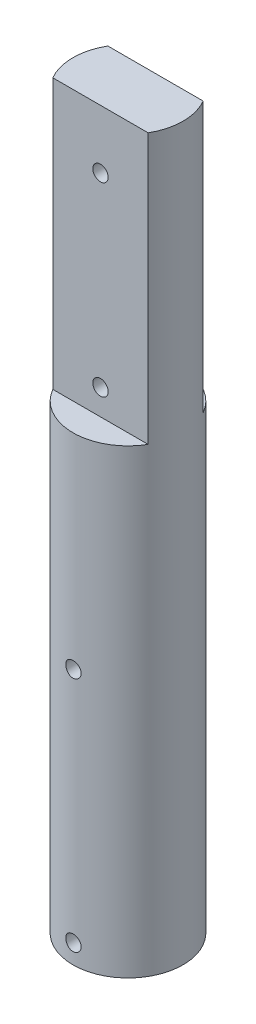
ISO-10303-21;
HEADER;
FILE_DESCRIPTION(('STEP AP214'),'2;1');
FILE_NAME('part.step','',(''),(''),'','','');
FILE_SCHEMA(('AUTOMOTIVE_DESIGN { 1 0 10303 214 1 1 1 1 }'));
ENDSEC;
DATA;
#1=APPLICATION_CONTEXT('core data for automotive mechanical design processes');
#2=APPLICATION_PROTOCOL_DEFINITION('international standard','automotive_design',2000,#1);
#3=PRODUCT_CONTEXT('',#1,'mechanical');
#4=PRODUCT('Part','Part','',(#3));
#5=PRODUCT_RELATED_PRODUCT_CATEGORY('part','',(#4));
#6=PRODUCT_DEFINITION_FORMATION('','',#4);
#7=PRODUCT_DEFINITION_CONTEXT('part definition',#1,'design');
#8=PRODUCT_DEFINITION('design','',#6,#7);
#9=PRODUCT_DEFINITION_SHAPE('','',#8);
#10=(LENGTH_UNIT() NAMED_UNIT(*) SI_UNIT(.MILLI.,.METRE.));
#11=(NAMED_UNIT(*) PLANE_ANGLE_UNIT() SI_UNIT($,.RADIAN.));
#12=(NAMED_UNIT(*) SI_UNIT($,.STERADIAN.) SOLID_ANGLE_UNIT());
#13=UNCERTAINTY_MEASURE_WITH_UNIT(LENGTH_MEASURE(1.E-05),#10,'distance_accuracy_value','');
#14=(GEOMETRIC_REPRESENTATION_CONTEXT(3) GLOBAL_UNCERTAINTY_ASSIGNED_CONTEXT((#13)) GLOBAL_UNIT_ASSIGNED_CONTEXT((#10,
#11,#12)) REPRESENTATION_CONTEXT('',''));
#15=CARTESIAN_POINT('',(0.,0.,0.));
#16=DIRECTION('',(0.,0.,1.));
#17=DIRECTION('',(1.,0.,0.));
#18=AXIS2_PLACEMENT_3D('',#15,#16,#17);
#19=CARTESIAN_POINT('',(0.,57.08,0.));
#20=DIRECTION('',(0.,-1.,0.));
#21=DIRECTION('',(0.,0.,-1.));
#22=AXIS2_PLACEMENT_3D('',#19,#20,#21);
#23=CYLINDRICAL_SURFACE('',#22,4.3);
#24=CARTESIAN_POINT('',(0.,20.6,-4.3));
#25=CARTESIAN_POINT('',(-0.0335275708954897,20.5999985978478,-4.29999948998828));
#26=CARTESIAN_POINT('',(-0.0670752568055947,20.5971802725972,-4.29960374919141));
#27=CARTESIAN_POINT('',(-0.133234765094414,20.5859832404072,-4.29806313788312));
#28=CARTESIAN_POINT('',(-0.165845612787704,20.5775989466993,-4.29691751470318));
#29=CARTESIAN_POINT('',(-0.229164259589988,20.5555238188583,-4.29400602126612));
#30=CARTESIAN_POINT('',(-0.259873409722147,20.5418368032867,-4.29224059742145));
#31=CARTESIAN_POINT('',(-0.318553827917283,20.5095536716102,-4.2882851399914));
#32=CARTESIAN_POINT('',(-0.346525514468045,20.4909583074777,-4.28609517146105));
#33=CARTESIAN_POINT('',(-0.399132362654931,20.4492514408053,-4.28151793661773));
#34=CARTESIAN_POINT('',(-0.423746219246013,20.4261131850964,-4.27912955238765));
#35=CARTESIAN_POINT('',(-0.468755033022216,20.3760348777371,-4.27443353651476));
#36=CARTESIAN_POINT('',(-0.489149760154739,20.349094618913,-4.27212590928101));
#37=CARTESIAN_POINT('',(-0.52522281386283,20.2920358674213,-4.26784178957295));
#38=CARTESIAN_POINT('',(-0.540880803565907,20.2619043998434,-4.26586674063646));
#39=CARTESIAN_POINT('',(-0.566905987390072,20.1994072364682,-4.26248646659039));
#40=CARTESIAN_POINT('',(-0.577273430901676,20.1670416460666,-4.26108121462185));
#41=CARTESIAN_POINT('',(-0.592357659935901,20.1012178549024,-4.25901051645618));
#42=CARTESIAN_POINT('',(-0.597110717131838,20.067768118182,-4.2583403234546));
#43=CARTESIAN_POINT('',(-0.600943561766012,20.000539603382,-4.25780117064252));
#44=CARTESIAN_POINT('',(-0.600023631787931,19.9667608417756,-4.25793217092285));
#45=CARTESIAN_POINT('',(-0.592566315008618,19.9000878341174,-4.25897626031051));
#46=CARTESIAN_POINT('',(-0.586069129458509,19.8671889913896,-4.25988375226073));
#47=CARTESIAN_POINT('',(-0.567704572579319,19.802953093001,-4.26236983738622));
#48=CARTESIAN_POINT('',(-0.555837068176971,19.7716160760626,-4.26394844719133));
#49=CARTESIAN_POINT('',(-0.527026323626942,19.7112699248211,-4.26760515516274));
#50=CARTESIAN_POINT('',(-0.510065861498754,19.6822691193085,-4.2696849432885));
#51=CARTESIAN_POINT('',(-0.471562935270107,19.6275099701351,-4.27410841247884));
#52=CARTESIAN_POINT('',(-0.450020210459266,19.6017518110992,-4.27645210855503));
#53=CARTESIAN_POINT('',(-0.402742670041643,19.5539759864553,-4.28116411843535));
#54=CARTESIAN_POINT('',(-0.376973251465276,19.5319925521903,-4.28353247001617));
#55=CARTESIAN_POINT('',(-0.322092287159642,19.4926575758627,-4.28800807840038));
#56=CARTESIAN_POINT('',(-0.292980730134554,19.4753060494557,-4.29011533432126));
#57=CARTESIAN_POINT('',(-0.232213629625436,19.44572644193,-4.29383310935159));
#58=CARTESIAN_POINT('',(-0.200556892049325,19.4335007825673,-4.29544339356825));
#59=CARTESIAN_POINT('',(-0.135612264376522,19.4145485681921,-4.29798376319159));
#60=CARTESIAN_POINT('',(-0.102324469702197,19.4078216918883,-4.2989138883393));
#61=CARTESIAN_POINT('',(-0.035358322451922,19.4001030056331,-4.29998392063015));
#62=CARTESIAN_POINT('',(-0.00168549874618523,19.3990640935691,-4.30013031761203));
#63=CARTESIAN_POINT('',(0.0653538297456085,19.4026261202611,-4.2996340014627));
#64=CARTESIAN_POINT('',(0.0987203426804372,19.4072269085437,-4.29899130938524));
#65=CARTESIAN_POINT('',(0.164058846929471,19.4218985824152,-4.29699305017726));
#66=CARTESIAN_POINT('',(0.196036041292868,19.4319467349736,-4.2956404464044));
#67=CARTESIAN_POINT('',(0.257851715539667,19.4572040834507,-4.29237363745077));
#68=CARTESIAN_POINT('',(0.287690106871596,19.4724134929082,-4.29045940903412));
#69=CARTESIAN_POINT('',(0.344589725167919,19.5076736387418,-4.28626620512982));
#70=CARTESIAN_POINT('',(0.371632107232839,19.527754514199,-4.28398498995698));
#71=CARTESIAN_POINT('',(0.421979686070998,19.5721453127426,-4.27931929765121));
#72=CARTESIAN_POINT('',(0.445284696155329,19.5964554469622,-4.27693481536744));
#73=CARTESIAN_POINT('',(0.487665504950375,19.6488234267959,-4.27231099718785));
#74=CARTESIAN_POINT('',(0.50670988071658,19.6769068202911,-4.27007282070155));
#75=CARTESIAN_POINT('',(0.539810994020148,19.7359015084937,-4.26601492837375));
#76=CARTESIAN_POINT('',(0.55386785157185,19.7668127351325,-4.26419520246346));
#77=CARTESIAN_POINT('',(0.576545242128529,19.8304885568759,-4.26118843893877));
#78=CARTESIAN_POINT('',(0.585182829287749,19.8632469806403,-4.25999941837257));
#79=CARTESIAN_POINT('',(0.596831068495093,19.9297671612301,-4.25838324196421));
#80=CARTESIAN_POINT('',(0.599842052660964,19.9635288587164,-4.25795604115468));
#81=CARTESIAN_POINT('',(0.600144507298717,20.0307842941412,-4.25791339524925));
#82=CARTESIAN_POINT('',(0.597485363562369,20.0642778161177,-4.25829094094571));
#83=CARTESIAN_POINT('',(0.58662832621675,20.1303365967041,-4.25980008766519));
#84=CARTESIAN_POINT('',(0.578430436973299,20.1629018560456,-4.26093168809384));
#85=CARTESIAN_POINT('',(0.556745207820723,20.2261691602408,-4.26381911509842));
#86=CARTESIAN_POINT('',(0.54326085208305,20.2568722450073,-4.26557458944993));
#87=CARTESIAN_POINT('',(0.5113903264641,20.3155881392943,-4.26951245715507));
#88=CARTESIAN_POINT('',(0.493004036126811,20.3436008826815,-4.27169486099936));
#89=CARTESIAN_POINT('',(0.451670399710898,20.3963925549525,-4.27626338760595));
#90=CARTESIAN_POINT('',(0.428686359899417,20.4211426233099,-4.27865105496591));
#91=CARTESIAN_POINT('',(0.378886995784174,20.4664525970426,-4.28334785151524));
#92=CARTESIAN_POINT('',(0.352070777188078,20.4870115216311,-4.28565696221616));
#93=CARTESIAN_POINT('',(0.295220169181282,20.5234410796524,-4.28994881478982));
#94=CARTESIAN_POINT('',(0.26517113814944,20.5392890451705,-4.29192995897052));
#95=CARTESIAN_POINT('',(0.202825627356861,20.5656901543197,-4.29532682280706));
#96=CARTESIAN_POINT('',(0.170531567358776,20.5762489010869,-4.29674314048629));
#97=CARTESIAN_POINT('',(0.11506875787627,20.5893179403315,-4.29851944143484));
#98=CARTESIAN_POINT('',(0.0922458092193598,20.5933177536102,-4.29907186458088));
#99=CARTESIAN_POINT('',(0.0462851008623457,20.5986592541178,-4.29981231808903));
#100=CARTESIAN_POINT('',(0.0231473443262198,20.6000009680421,-4.30000035211072));
#101=CARTESIAN_POINT('',(0.,20.6,-4.3));
#102=B_SPLINE_CURVE_WITH_KNOTS('',3,(#24,#25,#26,#27,#28,#29,#30,#31,#32,#33,#34,#35,#36,#37,
#38,#39,#40,#41,#42,#43,#44,#45,#46,#47,#48,#49,#50,#51,#52,#53,#54,#55,#56,#57,#58,#59,#60,#61,
#62,#63,#64,#65,#66,#67,#68,#69,#70,#71,#72,#73,#74,#75,#76,#77,#78,#79,#80,#81,#82,#83,#84,#85,
#86,#87,#88,#89,#90,#91,#92,#93,#94,#95,#96,#97,#98,#99,#100,#101),.UNSPECIFIED.,.T.,.F.,(4,2,2,
2,2,2,2,2,2,2,2,2,2,2,2,2,2,2,2,2,2,2,2,2,2,2,2,2,2,2,2,2,2,2,2,2,2,2,4),(0.,0.100498144631237,
0.201097315798383,0.30162417839486,0.402135648934119,0.50325781806992,0.604385499548968,
0.705941397439209,0.807492507654049,0.908383896114991,1.00927025899966,1.1094354742126,
1.20960317159514,1.31011347802753,1.41062950458006,1.51201376490475,1.61339836789992,
1.71483081701727,1.81625733906144,1.91684266169334,2.01742530065855,2.11759138192519,
2.21776160791049,2.31856812897261,2.41937968394664,2.52091187963721,2.6224416319992,
2.72365025159284,2.82485289702399,2.92517768800756,3.02550239991196,3.12577056060965,
3.22604118543984,3.32714649764197,3.42827544282475,3.5298833975973,3.63138348510181,
3.700767829357,3.7701514767789),.UNSPECIFIED.);
#103=CARTESIAN_POINT('',(0.,20.6,-4.3));
#104=VERTEX_POINT('',#103);
#105=EDGE_CURVE('E11',#104,#104,#102,.T.);
#106=ORIENTED_EDGE('',*,*,#105,.T.);
#107=EDGE_LOOP('',(#106));
#108=FACE_BOUND('',#107,.T.);
#109=CARTESIAN_POINT('',(0.600000000000002,20.,4.25793377120875));
#110=CARTESIAN_POINT('',(0.599998596295426,19.9664742202909,4.25793430012104));
#111=CARTESIAN_POINT('',(0.597180562007332,19.9329283205578,4.25833401086069));
#112=CARTESIAN_POINT('',(0.585984790455614,19.8667725228749,4.25988879424771));
#113=CARTESIAN_POINT('',(0.577601460026842,19.8341636010267,4.26104462678624));
#114=CARTESIAN_POINT('',(0.555529149502573,19.7708490284595,4.26397824842413));
#115=CARTESIAN_POINT('',(0.541844033576982,19.7401420104136,4.26575558445328));
#116=CARTESIAN_POINT('',(0.509565376901618,19.6814651719407,4.26973141114822));
#117=CARTESIAN_POINT('',(0.490972583540944,19.6534949356181,4.27192983767227));
#118=CARTESIAN_POINT('',(0.449268326315554,19.6008864798205,4.27651721618567));
#119=CARTESIAN_POINT('',(0.426129533826407,19.5762700176842,4.27890726597518));
#120=CARTESIAN_POINT('',(0.376049054908142,19.531256166575,4.28359876394619));
#121=CARTESIAN_POINT('',(0.349107168457574,19.5108589996526,4.28590020745939));
#122=CARTESIAN_POINT('',(0.292046961153537,19.4747833707848,4.29016657082425));
#123=CARTESIAN_POINT('',(0.261915945421763,19.4591248041596,4.29213005727407));
#124=CARTESIAN_POINT('',(0.19941976311111,19.4330984294994,4.29548715382562));
#125=CARTESIAN_POINT('',(0.167054699129085,19.4227303786848,4.29688079007695));
#126=CARTESIAN_POINT('',(0.101232641053802,19.4076449158011,4.29893342127308));
#127=CARTESIAN_POINT('',(0.0677841244297413,19.4028911670605,4.29959713842488));
#128=CARTESIAN_POINT('',(0.000558007541838529,19.3990565164659,4.30013130804566));
#129=CARTESIAN_POINT('',(-0.0332195766999144,19.3999753397828,4.3000017989455));
#130=CARTESIAN_POINT('',(-0.0998974001463253,19.4074308803803,4.29896790198468));
#131=CARTESIAN_POINT('',(-0.132802105181252,19.4139285113459,4.2980689054519));
#132=CARTESIAN_POINT('',(-0.197049497264932,19.4322959817346,4.2956030641155));
#133=CARTESIAN_POINT('',(-0.228392148593683,19.444165943946,4.29403620404744));
#134=CARTESIAN_POINT('',(-0.288745223083572,19.4729818263627,4.29040139870199));
#135=CARTESIAN_POINT('',(-0.317747590654341,19.4899444032253,4.28833181344418));
#136=CARTESIAN_POINT('',(-0.372508971958373,19.5284518693034,4.28392260871992));
#137=CARTESIAN_POINT('',(-0.398267800480895,19.5499970200019,4.28158297384784));
#138=CARTESIAN_POINT('',(-0.446040975382723,19.5972763116646,4.27687148671639));
#139=CARTESIAN_POINT('',(-0.468021577451512,19.6230445527966,4.27449952974786));
#140=CARTESIAN_POINT('',(-0.507351396087955,19.6779221414956,4.27001026095443));
#141=CARTESIAN_POINT('',(-0.524700590924096,19.707031504739,4.26789295032441));
#142=CARTESIAN_POINT('',(-0.554278508405505,19.7677979481793,4.26415276595435));
#143=CARTESIAN_POINT('',(-0.566504100600581,19.7994565718993,4.26253019465761));
#144=CARTESIAN_POINT('',(-0.585455605559508,19.8644053085682,4.25996878377682));
#145=CARTESIAN_POINT('',(-0.59218185144549,19.8976953225662,4.2590299027787));
#146=CARTESIAN_POINT('',(-0.599898153705322,19.9646626006186,4.25794991745381));
#147=CARTESIAN_POINT('',(-0.600935892079844,19.9983342674383,4.25780218185914));
#148=CARTESIAN_POINT('',(-0.597371930882645,20.0653710025916,4.25830363969808));
#149=CARTESIAN_POINT('',(-0.592770382013289,20.0987360790944,4.2589528118354));
#150=CARTESIAN_POINT('',(-0.578098780741735,20.1640669333002,4.26096886684335));
#151=CARTESIAN_POINT('',(-0.568052189581507,20.1960380830949,4.26233266972939));
#152=CARTESIAN_POINT('',(-0.542799981718085,20.2578423565912,4.26562180100149));
#153=CARTESIAN_POINT('',(-0.527594142158211,20.2876753878681,4.26754715364351));
#154=CARTESIAN_POINT('',(-0.492339339686814,20.3445711940587,4.27175818640371));
#155=CARTESIAN_POINT('',(-0.472259333209609,20.3716145619347,4.27404614215043));
#156=CARTESIAN_POINT('',(-0.427869668813237,20.4219645328803,4.27871760884022));
#157=CARTESIAN_POINT('',(-0.403559804823152,20.4452709537862,4.28110112443443));
#158=CARTESIAN_POINT('',(-0.351191243913934,20.4876550404661,4.28571572142422));
#159=CARTESIAN_POINT('',(-0.323106944109374,20.5067012234714,4.28794558878703));
#160=CARTESIAN_POINT('',(-0.264109939406158,20.539805504514,4.29198310160071));
#161=CARTESIAN_POINT('',(-0.233197303202059,20.5538637236586,4.29379075730246));
#162=CARTESIAN_POINT('',(-0.169522186173648,20.5765419670122,4.29677482532511));
#163=CARTESIAN_POINT('',(-0.136766089095656,20.5851796347605,4.29795328375317));
#164=CARTESIAN_POINT('',(-0.0702508340980199,20.5968288227083,4.29955472692375));
#165=CARTESIAN_POINT('',(-0.0364917332478421,20.5998406623888,4.29997775456582));
#166=CARTESIAN_POINT('',(0.0307649940909206,20.6001457063712,4.30002034330506));
#167=CARTESIAN_POINT('',(0.0642624072067582,20.597487243534,4.29964669516435));
#168=CARTESIAN_POINT('',(0.1303291452491,20.5866302032224,4.29815151878314));
#169=CARTESIAN_POINT('',(0.162898472037347,20.5784316368622,4.29702999204301));
#170=CARTESIAN_POINT('',(0.226174268636662,20.5567434169061,4.29416447681792));
#171=CARTESIAN_POINT('',(0.25688174819865,20.5432566614766,4.29242082933027));
#172=CARTESIAN_POINT('',(0.31560543741988,20.5113799689834,4.28850327141806));
#173=CARTESIAN_POINT('',(0.343621583678997,20.4929899164506,4.28632935086119));
#174=CARTESIAN_POINT('',(0.396413325597725,20.4516520299904,4.2817712786857));
#175=CARTESIAN_POINT('',(0.421160735035163,20.4286683697711,4.27938556210956));
#176=CARTESIAN_POINT('',(0.466465520729515,20.3788708739079,4.27468479245348));
#177=CARTESIAN_POINT('',(0.487021909091961,20.3520561377422,4.27236975614315));
#178=CARTESIAN_POINT('',(0.523448604597854,20.2952068464316,4.26806052336625));
#179=CARTESIAN_POINT('',(0.539295821911606,20.2651573793649,4.26606792891221));
#180=CARTESIAN_POINT('',(0.565695413029659,20.2028109684398,4.26264794022746));
#181=CARTESIAN_POINT('',(0.576253398389031,20.1705164480625,4.26121994732925));
#182=CARTESIAN_POINT('',(0.589320387551261,20.1150556546422,4.25942821988946));
#183=CARTESIAN_POINT('',(0.593319279204645,20.0922353254453,4.25887069256528));
#184=CARTESIAN_POINT('',(0.59865955612177,20.0462798583224,4.25812328757004));
#185=CARTESIAN_POINT('',(0.6000009690559,20.0231447236767,4.25793340607097));
#186=CARTESIAN_POINT('',(0.600000000000002,20.,4.25793377120875));
#187=B_SPLINE_CURVE_WITH_KNOTS('',3,(#109,#110,#111,#112,#113,#114,#115,#116,#117,#118,#119,
#120,#121,#122,#123,#124,#125,#126,#127,#128,#129,#130,#131,#132,#133,#134,#135,#136,#137,#138,
#139,#140,#141,#142,#143,#144,#145,#146,#147,#148,#149,#150,#151,#152,#153,#154,#155,#156,#157,
#158,#159,#160,#161,#162,#163,#164,#165,#166,#167,#168,#169,#170,#171,#172,#173,#174,#175,#176,
#177,#178,#179,#180,#181,#182,#183,#184,#185,#186),.UNSPECIFIED.,.T.,.F.,(4,2,2,2,2,2,2,2,2,2,2,
2,2,2,2,2,2,2,2,2,2,2,2,2,2,2,2,2,2,2,2,2,2,2,2,2,2,2,4),(0.,0.100492763153889,
0.201086675510695,0.301607408201596,0.402112841435891,0.50324205466339,0.604376588704395,
0.705930032479188,0.807478815593279,0.908366692649046,1.00924968184822,1.10943157780052,
1.20961576359538,1.3101312640464,1.41065250147672,1.51202949450334,1.61340696320322,
1.71484628214602,1.81627945596097,1.91686108513569,2.01744002646031,2.11758900571794,
2.21774231151875,2.31855104945869,2.41936469999173,2.52090039864442,2.62243363185517,
2.72363464315493,2.82482990724942,2.92516604604304,3.02550198354815,3.12578300911534,
3.22606639643806,3.32716478287199,3.42828697242148,3.52989709562866,3.63139918712562,
3.70077569299435,3.77015147649228),.UNSPECIFIED.);
#188=CARTESIAN_POINT('',(0.600000000000002,20.,4.25793377120875));
#189=VERTEX_POINT('',#188);
#190=EDGE_CURVE('E46',#189,#189,#187,.T.);
#191=ORIENTED_EDGE('',*,*,#190,.T.);
#192=EDGE_LOOP('',(#191));
#193=FACE_BOUND('',#192,.T.);
#194=CARTESIAN_POINT('',(0.,2.09999999999999,-4.3));
#195=CARTESIAN_POINT('',(-0.0335275708954902,2.09999859784776,-4.29999948998828));
#196=CARTESIAN_POINT('',(-0.0670752568055957,2.09718027259714,-4.29960374919141));
#197=CARTESIAN_POINT('',(-0.133234765094415,2.08598324040722,-4.29806313788312));
#198=CARTESIAN_POINT('',(-0.165845612787705,2.07759894669932,-4.29691751470318));
#199=CARTESIAN_POINT('',(-0.229164259589988,2.05552381885833,-4.29400602126612));
#200=CARTESIAN_POINT('',(-0.259873409722147,2.04183680328669,-4.29224059742145));
#201=CARTESIAN_POINT('',(-0.318553827917283,2.00955367161022,-4.2882851399914));
#202=CARTESIAN_POINT('',(-0.346525514468045,1.99095830747764,-4.28609517146105));
#203=CARTESIAN_POINT('',(-0.399132362654933,1.94925144080529,-4.28151793661773));
#204=CARTESIAN_POINT('',(-0.423746219246016,1.92611318509639,-4.27912955238765));
#205=CARTESIAN_POINT('',(-0.468755033022219,1.87603487773707,-4.27443353651476));
#206=CARTESIAN_POINT('',(-0.489149760154741,1.84909461891298,-4.27212590928101));
#207=CARTESIAN_POINT('',(-0.525222813862831,1.79203586742129,-4.26784178957295));
#208=CARTESIAN_POINT('',(-0.540880803565908,1.76190439984341,-4.26586674063646));
#209=CARTESIAN_POINT('',(-0.566905987390074,1.6994072364682,-4.26248646659039));
#210=CARTESIAN_POINT('',(-0.577273430901679,1.66704164606662,-4.26108121462185));
#211=CARTESIAN_POINT('',(-0.592357659935902,1.60121785490242,-4.25901051645618));
#212=CARTESIAN_POINT('',(-0.59711071713184,1.56776811818198,-4.2583403234546));
#213=CARTESIAN_POINT('',(-0.600943561766014,1.500539603382,-4.25780117064252));
#214=CARTESIAN_POINT('',(-0.600023631787933,1.46676084177559,-4.25793217092285));
#215=CARTESIAN_POINT('',(-0.592566315008621,1.40008783411737,-4.25897626031051));
#216=CARTESIAN_POINT('',(-0.586069129458513,1.3671889913896,-4.25988375226073));
#217=CARTESIAN_POINT('',(-0.567704572579322,1.30295309300097,-4.26236983738622));
#218=CARTESIAN_POINT('',(-0.555837068176975,1.27161607606257,-4.26394844719133));
#219=CARTESIAN_POINT('',(-0.527026323626947,1.21126992482106,-4.26760515516274));
#220=CARTESIAN_POINT('',(-0.510065861498758,1.18226911930847,-4.2696849432885));
#221=CARTESIAN_POINT('',(-0.471562935270112,1.12750997013506,-4.27410841247884));
#222=CARTESIAN_POINT('',(-0.450020210459271,1.1017518110992,-4.27645210855503));
#223=CARTESIAN_POINT('',(-0.402742670041647,1.05397598645531,-4.28116411843535));
#224=CARTESIAN_POINT('',(-0.37697325146528,1.03199255219027,-4.28353247001617));
#225=CARTESIAN_POINT('',(-0.322092287159646,0.992657575862646,-4.28800807840038));
#226=CARTESIAN_POINT('',(-0.292980730134558,0.975306049455742,-4.29011533432126));
#227=CARTESIAN_POINT('',(-0.23221362962544,0.94572644192998,-4.29383310935158));
#228=CARTESIAN_POINT('',(-0.200556892049327,0.933500782567258,-4.29544339356825));
#229=CARTESIAN_POINT('',(-0.135612264376524,0.914548568192063,-4.29798376319159));
#230=CARTESIAN_POINT('',(-0.102324469702201,0.907821691888326,-4.2989138883393));
#231=CARTESIAN_POINT('',(-0.0353583224519261,0.900103005633047,-4.29998392063015));
#232=CARTESIAN_POINT('',(-0.00168549874618927,0.899064093569095,-4.30013031761203));
#233=CARTESIAN_POINT('',(0.0653538297456044,0.902626120261055,-4.2996340014627));
#234=CARTESIAN_POINT('',(0.0987203426804331,0.907226908543668,-4.29899130938524));
#235=CARTESIAN_POINT('',(0.164058846929467,0.921898582415187,-4.29699305017726));
#236=CARTESIAN_POINT('',(0.196036041292865,0.931946734973559,-4.2956404464044));
#237=CARTESIAN_POINT('',(0.257851715539664,0.957204083450664,-4.29237363745077));
#238=CARTESIAN_POINT('',(0.287690106871592,0.972413492908244,-4.29045940903412));
#239=CARTESIAN_POINT('',(0.344589725167915,1.00767363874183,-4.28626620512982));
#240=CARTESIAN_POINT('',(0.371632107232836,1.02775451419904,-4.28398498995698));
#241=CARTESIAN_POINT('',(0.421979686070996,1.07214531274262,-4.27931929765121));
#242=CARTESIAN_POINT('',(0.445284696155326,1.09645544696221,-4.27693481536744));
#243=CARTESIAN_POINT('',(0.487665504950372,1.1488234267959,-4.27231099718785));
#244=CARTESIAN_POINT('',(0.506709880716576,1.1769068202911,-4.27007282070155));
#245=CARTESIAN_POINT('',(0.539810994020144,1.23590150849364,-4.26601492837375));
#246=CARTESIAN_POINT('',(0.553867851571846,1.2668127351325,-4.26419520246346));
#247=CARTESIAN_POINT('',(0.576545242128525,1.3304885568759,-4.26118843893877));
#248=CARTESIAN_POINT('',(0.585182829287745,1.36324698064032,-4.25999941837257));
#249=CARTESIAN_POINT('',(0.59683106849509,1.42976716123009,-4.25838324196421));
#250=CARTESIAN_POINT('',(0.599842052660961,1.46352885871636,-4.25795604115468));
#251=CARTESIAN_POINT('',(0.600144507298715,1.53078429414122,-4.25791339524925));
#252=CARTESIAN_POINT('',(0.597485363562367,1.56427781611773,-4.25829094094571));
#253=CARTESIAN_POINT('',(0.586628326216748,1.63033659670407,-4.25980008766519));
#254=CARTESIAN_POINT('',(0.578430436973297,1.66290185604555,-4.26093168809384));
#255=CARTESIAN_POINT('',(0.556745207820721,1.72616916024079,-4.26381911509842));
#256=CARTESIAN_POINT('',(0.543260852083047,1.7568722450073,-4.26557458944993));
#257=CARTESIAN_POINT('',(0.511390326464099,1.81558813929425,-4.26951245715507));
#258=CARTESIAN_POINT('',(0.493004036126811,1.84360088268151,-4.27169486099936));
#259=CARTESIAN_POINT('',(0.451670399710899,1.89639255495253,-4.27626338760595));
#260=CARTESIAN_POINT('',(0.428686359899418,1.92114262330992,-4.27865105496591));
#261=CARTESIAN_POINT('',(0.378886995784175,1.96645259704263,-4.28334785151524));
#262=CARTESIAN_POINT('',(0.352070777188078,1.98701152163108,-4.28565696221616));
#263=CARTESIAN_POINT('',(0.295220169181282,2.02344107965237,-4.28994881478982));
#264=CARTESIAN_POINT('',(0.265171138149441,2.03928904517046,-4.29192995897052));
#265=CARTESIAN_POINT('',(0.202825627356861,2.06569015431973,-4.29532682280706));
#266=CARTESIAN_POINT('',(0.170531567358777,2.07624890108687,-4.29674314048629));
#267=CARTESIAN_POINT('',(0.115068757876271,2.08931794033148,-4.29851944143484));
#268=CARTESIAN_POINT('',(0.0922458092193608,2.0933177536102,-4.29907186458088));
#269=CARTESIAN_POINT('',(0.0462851008623465,2.09865925411781,-4.29981231808903));
#270=CARTESIAN_POINT('',(0.0231473443262201,2.1000009680421,-4.30000035211072));
#271=CARTESIAN_POINT('',(0.,2.09999999999999,-4.3));
#272=B_SPLINE_CURVE_WITH_KNOTS('',3,(#194,#195,#196,#197,#198,#199,#200,#201,#202,#203,#204,
#205,#206,#207,#208,#209,#210,#211,#212,#213,#214,#215,#216,#217,#218,#219,#220,#221,#222,#223,
#224,#225,#226,#227,#228,#229,#230,#231,#232,#233,#234,#235,#236,#237,#238,#239,#240,#241,#242,
#243,#244,#245,#246,#247,#248,#249,#250,#251,#252,#253,#254,#255,#256,#257,#258,#259,#260,#261,
#262,#263,#264,#265,#266,#267,#268,#269,#270,#271),.UNSPECIFIED.,.T.,.F.,(4,2,2,2,2,2,2,2,2,2,2,
2,2,2,2,2,2,2,2,2,2,2,2,2,2,2,2,2,2,2,2,2,2,2,2,2,2,2,4),(0.,0.100498144631238,
0.201097315798383,0.301624178394859,0.402135648934119,0.503257818069923,0.604385499548968,
0.705941397439205,0.807492507654049,0.908383896114985,1.00927025899966,1.10943547421259,
1.20960317159513,1.31011347802753,1.41062950458006,1.51201376490475,1.61339836789992,
1.71483081701727,1.81625733906144,1.91684266169333,2.01742530065855,2.11759138192519,
2.21776160791049,2.31856812897261,2.41937968394664,2.52091187963721,2.6224416319992,
2.72365025159284,2.82485289702399,2.92517768800756,3.02550239991196,3.12577056060965,
3.22604118543983,3.32714649764197,3.42827544282475,3.5298833975973,3.63138348510181,
3.70076782935699,3.7701514767789),.UNSPECIFIED.);
#273=CARTESIAN_POINT('',(0.,2.09999999999999,-4.3));
#274=VERTEX_POINT('',#273);
#275=EDGE_CURVE('E125',#274,#274,#272,.T.);
#276=ORIENTED_EDGE('',*,*,#275,.T.);
#277=EDGE_LOOP('',(#276));
#278=FACE_BOUND('',#277,.T.);
#279=CARTESIAN_POINT('',(0.6,1.5,4.25793377120875));
#280=CARTESIAN_POINT('',(0.599998596295424,1.46647422029086,4.25793430012105));
#281=CARTESIAN_POINT('',(0.59718056200733,1.43292832055775,4.25833401086069));
#282=CARTESIAN_POINT('',(0.585984790455612,1.36677252287489,4.25988879424771));
#283=CARTESIAN_POINT('',(0.57760146002684,1.33416360102667,4.26104462678624));
#284=CARTESIAN_POINT('',(0.55552914950257,1.27084902845948,4.26397824842413));
#285=CARTESIAN_POINT('',(0.541844033576979,1.24014201041361,4.26575558445328));
#286=CARTESIAN_POINT('',(0.509565376901615,1.18146517194072,4.26973141114822));
#287=CARTESIAN_POINT('',(0.490972583540941,1.15349493561809,4.27192983767227));
#288=CARTESIAN_POINT('',(0.449268326315551,1.10088647982053,4.27651721618567));
#289=CARTESIAN_POINT('',(0.426129533826403,1.07627001768419,4.27890726597518));
#290=CARTESIAN_POINT('',(0.376049054908136,1.03125616657496,4.28359876394619));
#291=CARTESIAN_POINT('',(0.349107168457569,1.01085899965257,4.28590020745939));
#292=CARTESIAN_POINT('',(0.292046961153533,0.97478337078475,4.29016657082425));
#293=CARTESIAN_POINT('',(0.261915945421759,0.959124804159624,4.29213005727407));
#294=CARTESIAN_POINT('',(0.199419763111107,0.933098429499353,4.29548715382562));
#295=CARTESIAN_POINT('',(0.167054699129082,0.922730378684835,4.29688079007695));
#296=CARTESIAN_POINT('',(0.101232641053799,0.907644915801123,4.29893342127308));
#297=CARTESIAN_POINT('',(0.0677841244297386,0.902891167060472,4.29959713842488));
#298=CARTESIAN_POINT('',(0.000558007541835466,0.899056516465929,4.30013130804566));
#299=CARTESIAN_POINT('',(-0.0332195766999177,0.899975339782818,4.3000017989455));
#300=CARTESIAN_POINT('',(-0.0998974001463289,0.907430880380319,4.29896790198468));
#301=CARTESIAN_POINT('',(-0.132802105181256,0.913928511345886,4.2980689054519));
#302=CARTESIAN_POINT('',(-0.197049497264935,0.932295981734555,4.2956030641155));
#303=CARTESIAN_POINT('',(-0.228392148593686,0.944165943946025,4.29403620404744));
#304=CARTESIAN_POINT('',(-0.288745223083576,0.972981826362742,4.29040139870199));
#305=CARTESIAN_POINT('',(-0.317747590654344,0.989944403225249,4.28833181344418));
#306=CARTESIAN_POINT('',(-0.372508971958377,1.02845186930344,4.28392260871991));
#307=CARTESIAN_POINT('',(-0.398267800480898,1.04999702000194,4.28158297384784));
#308=CARTESIAN_POINT('',(-0.446040975382726,1.09727631166461,4.27687148671639));
#309=CARTESIAN_POINT('',(-0.468021577451516,1.12304455279656,4.27449952974786));
#310=CARTESIAN_POINT('',(-0.507351396087959,1.1779221414956,4.27001026095443));
#311=CARTESIAN_POINT('',(-0.5247005909241,1.20703150473901,4.26789295032441));
#312=CARTESIAN_POINT('',(-0.554278508405508,1.26779794817925,4.26415276595435));
#313=CARTESIAN_POINT('',(-0.566504100600583,1.29945657189932,4.26253019465761));
#314=CARTESIAN_POINT('',(-0.58545560555951,1.36440530856817,4.25996878377682));
#315=CARTESIAN_POINT('',(-0.592181851445492,1.3976953225662,4.2590299027787));
#316=CARTESIAN_POINT('',(-0.599898153705324,1.46466260061861,4.25794991745381));
#317=CARTESIAN_POINT('',(-0.600935892079846,1.49833426743828,4.25780218185914));
#318=CARTESIAN_POINT('',(-0.597371930882647,1.56537100259158,4.25830363969808));
#319=CARTESIAN_POINT('',(-0.592770382013291,1.59873607909441,4.2589528118354));
#320=CARTESIAN_POINT('',(-0.578098780741738,1.6640669333002,4.26096886684335));
#321=CARTESIAN_POINT('',(-0.56805218958151,1.69603808309493,4.26233266972939));
#322=CARTESIAN_POINT('',(-0.542799981718087,1.75784235659122,4.26562180100149));
#323=CARTESIAN_POINT('',(-0.527594142158214,1.7876753878681,4.26754715364351));
#324=CARTESIAN_POINT('',(-0.492339339686817,1.84457119405871,4.27175818640371));
#325=CARTESIAN_POINT('',(-0.472259333209612,1.87161456193474,4.27404614215043));
#326=CARTESIAN_POINT('',(-0.42786966881324,1.92196453288025,4.27871760884022));
#327=CARTESIAN_POINT('',(-0.403559804823154,1.94527095378616,4.28110112443443));
#328=CARTESIAN_POINT('',(-0.351191243913936,1.98765504046612,4.28571572142422));
#329=CARTESIAN_POINT('',(-0.323106944109376,2.00670122347136,4.28794558878703));
#330=CARTESIAN_POINT('',(-0.26410993940616,2.03980550451403,4.29198310160071));
#331=CARTESIAN_POINT('',(-0.23319730320206,2.05386372365854,4.29379075730246));
#332=CARTESIAN_POINT('',(-0.169522186173649,2.07654196701224,4.29677482532511));
#333=CARTESIAN_POINT('',(-0.136766089095656,2.08517963476051,4.29795328375316));
#334=CARTESIAN_POINT('',(-0.0702508340980209,2.09682882270824,4.29955472692375));
#335=CARTESIAN_POINT('',(-0.0364917332478431,2.09984066238877,4.29997775456582));
#336=CARTESIAN_POINT('',(0.0307649940909195,2.10014570637115,4.30002034330506));
#337=CARTESIAN_POINT('',(0.0642624072067569,2.09748724353404,4.29964669516435));
#338=CARTESIAN_POINT('',(0.130329145249099,2.08663020322243,4.29815151878314));
#339=CARTESIAN_POINT('',(0.162898472037345,2.0784316368622,4.29702999204301));
#340=CARTESIAN_POINT('',(0.226174268636661,2.05674341690608,4.29416447681792));
#341=CARTESIAN_POINT('',(0.256881748198649,2.04325666147655,4.29242082933027));
#342=CARTESIAN_POINT('',(0.315605437419879,2.01137996898339,4.28850327141806));
#343=CARTESIAN_POINT('',(0.343621583678996,1.99298991645059,4.28632935086119));
#344=CARTESIAN_POINT('',(0.396413325597723,1.95165202999039,4.2817712786857));
#345=CARTESIAN_POINT('',(0.421160735035161,1.92866836977108,4.27938556210956));
#346=CARTESIAN_POINT('',(0.466465520729513,1.87887087390787,4.27468479245348));
#347=CARTESIAN_POINT('',(0.48702190909196,1.85205613774218,4.27236975614315));
#348=CARTESIAN_POINT('',(0.523448604597853,1.7952068464316,4.26806052336625));
#349=CARTESIAN_POINT('',(0.539295821911604,1.76515737936488,4.26606792891221));
#350=CARTESIAN_POINT('',(0.565695413029657,1.70281096843975,4.26264794022746));
#351=CARTESIAN_POINT('',(0.576253398389029,1.67051644806249,4.26121994732925));
#352=CARTESIAN_POINT('',(0.589320387551259,1.61505565464218,4.25942821988946));
#353=CARTESIAN_POINT('',(0.593319279204643,1.59223532544531,4.25887069256528));
#354=CARTESIAN_POINT('',(0.598659556121768,1.54627985832237,4.25812328757004));
#355=CARTESIAN_POINT('',(0.600000969055897,1.52314472367666,4.25793340607097));
#356=CARTESIAN_POINT('',(0.6,1.5,4.25793377120875));
#357=B_SPLINE_CURVE_WITH_KNOTS('',3,(#279,#280,#281,#282,#283,#284,#285,#286,#287,#288,#289,
#290,#291,#292,#293,#294,#295,#296,#297,#298,#299,#300,#301,#302,#303,#304,#305,#306,#307,#308,
#309,#310,#311,#312,#313,#314,#315,#316,#317,#318,#319,#320,#321,#322,#323,#324,#325,#326,#327,
#328,#329,#330,#331,#332,#333,#334,#335,#336,#337,#338,#339,#340,#341,#342,#343,#344,#345,#346,
#347,#348,#349,#350,#351,#352,#353,#354,#355,#356),.UNSPECIFIED.,.T.,.F.,(4,2,2,2,2,2,2,2,2,2,2,
2,2,2,2,2,2,2,2,2,2,2,2,2,2,2,2,2,2,2,2,2,2,2,2,2,2,2,4),(0.,0.100492763153889,
0.201086675510695,0.301607408201596,0.402112841435892,0.503242054663393,0.604376588704398,
0.705930032479189,0.807478815593278,0.908366692649047,1.00924968184822,1.10943157780052,
1.20961576359538,1.3101312640464,1.41065250147672,1.51202949450334,1.61340696320322,
1.71484628214602,1.81627945596097,1.91686108513569,2.01744002646031,2.11758900571793,
2.21774231151875,2.31855104945869,2.41936469999173,2.52090039864442,2.62243363185517,
2.72363464315493,2.82482990724942,2.92516604604304,3.02550198354815,3.12578300911534,
3.22606639643806,3.32716478287199,3.42828697242149,3.52989709562866,3.63139918712562,
3.70077569299435,3.77015147649228),.UNSPECIFIED.);
#358=CARTESIAN_POINT('',(0.6,1.5,4.25793377120875));
#359=VERTEX_POINT('',#358);
#360=EDGE_CURVE('E116',#359,#359,#357,.T.);
#361=ORIENTED_EDGE('',*,*,#360,.T.);
#362=EDGE_LOOP('',(#361));
#363=FACE_BOUND('',#362,.T.);
#364=CARTESIAN_POINT('',(0.,57.08,0.));
#365=DIRECTION('',(0.,1.,0.));
#366=DIRECTION('',(0.,0.,1.));
#367=AXIS2_PLACEMENT_3D('',#364,#365,#366);
#368=CIRCLE('',#367,4.3);
#369=CARTESIAN_POINT('',(3.72390923627309,57.08,2.15));
#370=VERTEX_POINT('',#369);
#371=CARTESIAN_POINT('',(3.72390923627308,57.08,-2.15));
#372=VERTEX_POINT('',#371);
#373=EDGE_CURVE('E117',#370,#372,#368,.T.);
#374=ORIENTED_EDGE('',*,*,#373,.F.);
#375=DIRECTION('',(0.,1.,0.));
#376=VECTOR('',#375,1.);
#377=CARTESIAN_POINT('',(3.72390923627308,36.,2.15));
#378=LINE('',#377,#376);
#379=CARTESIAN_POINT('',(3.72390923627308,36.,2.15));
#380=VERTEX_POINT('',#379);
#381=EDGE_CURVE('E53',#380,#370,#378,.T.);
#382=ORIENTED_EDGE('',*,*,#381,.F.);
#383=CARTESIAN_POINT('',(0.,36.,0.));
#384=DIRECTION('',(0.,1.,0.));
#385=DIRECTION('',(0.,0.,1.));
#386=AXIS2_PLACEMENT_3D('',#383,#384,#385);
#387=CIRCLE('',#386,4.3);
#388=CARTESIAN_POINT('',(-3.72390923627308,36.,2.15));
#389=VERTEX_POINT('',#388);
#390=EDGE_CURVE('E83',#389,#380,#387,.T.);
#391=ORIENTED_EDGE('',*,*,#390,.F.);
#392=DIRECTION('',(0.,1.,0.));
#393=VECTOR('',#392,1.);
#394=CARTESIAN_POINT('',(-3.72390923627308,36.,2.15));
#395=LINE('',#394,#393);
#396=CARTESIAN_POINT('',(-3.72390923627308,57.08,2.15));
#397=VERTEX_POINT('',#396);
#398=EDGE_CURVE('E87',#389,#397,#395,.T.);
#399=ORIENTED_EDGE('',*,*,#398,.T.);
#400=CARTESIAN_POINT('',(-3.72390923627309,57.08,-2.15));
#401=VERTEX_POINT('',#400);
#402=EDGE_CURVE('E114',#401,#397,#368,.T.);
#403=ORIENTED_EDGE('',*,*,#402,.F.);
#404=DIRECTION('',(0.,1.,0.));
#405=VECTOR('',#404,1.);
#406=CARTESIAN_POINT('',(-3.72390923627308,36.,-2.15));
#407=LINE('',#406,#405);
#408=CARTESIAN_POINT('',(-3.72390923627308,36.,-2.15));
#409=VERTEX_POINT('',#408);
#410=EDGE_CURVE('E61',#409,#401,#407,.T.);
#411=ORIENTED_EDGE('',*,*,#410,.F.);
#412=CARTESIAN_POINT('',(0.,36.,0.));
#413=DIRECTION('',(0.,1.,0.));
#414=DIRECTION('',(0.,0.,-1.));
#415=AXIS2_PLACEMENT_3D('',#412,#413,#414);
#416=CIRCLE('',#415,4.3);
#417=CARTESIAN_POINT('',(3.72390923627308,36.,-2.15));
#418=VERTEX_POINT('',#417);
#419=EDGE_CURVE('E105',#418,#409,#416,.T.);
#420=ORIENTED_EDGE('',*,*,#419,.F.);
#421=DIRECTION('',(0.,1.,0.));
#422=VECTOR('',#421,1.);
#423=CARTESIAN_POINT('',(3.72390923627308,36.,-2.15));
#424=LINE('',#423,#422);
#425=EDGE_CURVE('E108',#418,#372,#424,.T.);
#426=ORIENTED_EDGE('',*,*,#425,.T.);
#427=EDGE_LOOP('',(#374,#382,#391,#399,#403,#411,#420,#426));
#428=FACE_BOUND('',#427,.T.);
#429=CARTESIAN_POINT('',(0.,0.,0.));
#430=DIRECTION('',(0.,1.,0.));
#431=DIRECTION('',(0.,0.,1.));
#432=AXIS2_PLACEMENT_3D('',#429,#430,#431);
#433=CIRCLE('',#432,4.3);
#434=CARTESIAN_POINT('',(0.,0.,4.3));
#435=VERTEX_POINT('',#434);
#436=EDGE_CURVE('E111',#435,#435,#433,.T.);
#437=ORIENTED_EDGE('',*,*,#436,.T.);
#438=EDGE_LOOP('',(#437));
#439=FACE_BOUND('',#438,.T.);
#440=ADVANCED_FACE('F35',(#108,#193,#278,#363,#428,#439),#23,.T.);
#441=CARTESIAN_POINT('',(0.,57.08,0.));
#442=DIRECTION('',(0.,1.,0.));
#443=DIRECTION('',(0.,0.,1.));
#444=AXIS2_PLACEMENT_3D('',#441,#442,#443);
#445=PLANE('',#444);
#446=DIRECTION('',(-1.,0.,0.));
#447=VECTOR('',#446,1.);
#448=CARTESIAN_POINT('',(0.,57.08,2.15));
#449=LINE('',#448,#447);
#450=EDGE_CURVE('E84',#370,#397,#449,.T.);
#451=ORIENTED_EDGE('',*,*,#450,.F.);
#452=ORIENTED_EDGE('',*,*,#373,.T.);
#453=DIRECTION('',(1.,0.,0.));
#454=VECTOR('',#453,1.);
#455=CARTESIAN_POINT('',(0.,57.08,-2.15));
#456=LINE('',#455,#454);
#457=EDGE_CURVE('E100',#401,#372,#456,.T.);
#458=ORIENTED_EDGE('',*,*,#457,.F.);
#459=ORIENTED_EDGE('',*,*,#402,.T.);
#460=EDGE_LOOP('',(#451,#452,#458,#459));
#461=FACE_BOUND('',#460,.T.);
#462=ADVANCED_FACE('F150',(#461),#445,.T.);
#463=CARTESIAN_POINT('',(0.,0.,0.));
#464=DIRECTION('',(0.,1.,0.));
#465=DIRECTION('',(0.,0.,1.));
#466=AXIS2_PLACEMENT_3D('',#463,#464,#465);
#467=PLANE('',#466);
#468=ORIENTED_EDGE('',*,*,#436,.F.);
#469=EDGE_LOOP('',(#468));
#470=FACE_BOUND('',#469,.T.);
#471=ADVANCED_FACE('F148',(#470),#467,.F.);
#472=CARTESIAN_POINT('',(0.,36.,-2.15));
#473=DIRECTION('',(0.,0.,1.));
#474=DIRECTION('',(1.,0.,0.));
#475=AXIS2_PLACEMENT_3D('',#472,#473,#474);
#476=PLANE('',#475);
#477=CARTESIAN_POINT('',(0.,52.5,-2.15));
#478=DIRECTION('',(0.,0.,1.));
#479=DIRECTION('',(1.,0.,0.));
#480=AXIS2_PLACEMENT_3D('',#477,#478,#479);
#481=CIRCLE('',#480,0.600000000000001);
#482=CARTESIAN_POINT('',(0.6,52.5,-2.15));
#483=VERTEX_POINT('',#482);
#484=EDGE_CURVE('E191',#483,#483,#481,.T.);
#485=ORIENTED_EDGE('',*,*,#484,.T.);
#486=EDGE_LOOP('',(#485));
#487=FACE_BOUND('',#486,.T.);
#488=CARTESIAN_POINT('',(0.,38.,-2.15));
#489=DIRECTION('',(0.,0.,1.));
#490=DIRECTION('',(1.,0.,0.));
#491=AXIS2_PLACEMENT_3D('',#488,#489,#490);
#492=CIRCLE('',#491,0.600000000000001);
#493=CARTESIAN_POINT('',(0.6,38.,-2.15));
#494=VERTEX_POINT('',#493);
#495=EDGE_CURVE('E99',#494,#494,#492,.T.);
#496=ORIENTED_EDGE('',*,*,#495,.T.);
#497=EDGE_LOOP('',(#496));
#498=FACE_BOUND('',#497,.T.);
#499=ORIENTED_EDGE('',*,*,#457,.T.);
#500=ORIENTED_EDGE('',*,*,#425,.F.);
#501=DIRECTION('',(1.,0.,0.));
#502=VECTOR('',#501,1.);
#503=CARTESIAN_POINT('',(0.,36.,-2.15));
#504=LINE('',#503,#502);
#505=EDGE_CURVE('E102',#409,#418,#504,.T.);
#506=ORIENTED_EDGE('',*,*,#505,.F.);
#507=ORIENTED_EDGE('',*,*,#410,.T.);
#508=EDGE_LOOP('',(#499,#500,#506,#507));
#509=FACE_BOUND('',#508,.T.);
#510=ADVANCED_FACE('F144',(#487,#498,#509),#476,.F.);
#511=CARTESIAN_POINT('',(0.,36.,0.));
#512=DIRECTION('',(0.,-1.,0.));
#513=DIRECTION('',(0.,0.,-1.));
#514=AXIS2_PLACEMENT_3D('',#511,#512,#513);
#515=PLANE('',#514);
#516=ORIENTED_EDGE('',*,*,#505,.T.);
#517=ORIENTED_EDGE('',*,*,#419,.T.);
#518=EDGE_LOOP('',(#516,#517));
#519=FACE_BOUND('',#518,.T.);
#520=ADVANCED_FACE('F140',(#519),#515,.F.);
#521=CARTESIAN_POINT('',(0.,36.,2.15));
#522=DIRECTION('',(0.,0.,-1.));
#523=DIRECTION('',(-1.,0.,0.));
#524=AXIS2_PLACEMENT_3D('',#521,#522,#523);
#525=PLANE('',#524);
#526=CARTESIAN_POINT('',(0.,52.5,2.15));
#527=DIRECTION('',(0.,0.,1.));
#528=DIRECTION('',(1.,0.,0.));
#529=AXIS2_PLACEMENT_3D('',#526,#527,#528);
#530=CIRCLE('',#529,0.600000000000001);
#531=CARTESIAN_POINT('',(0.6,52.5,2.15));
#532=VERTEX_POINT('',#531);
#533=EDGE_CURVE('E188',#532,#532,#530,.T.);
#534=ORIENTED_EDGE('',*,*,#533,.F.);
#535=EDGE_LOOP('',(#534));
#536=FACE_BOUND('',#535,.T.);
#537=CARTESIAN_POINT('',(0.,38.,2.15));
#538=DIRECTION('',(0.,0.,1.));
#539=DIRECTION('',(1.,0.,0.));
#540=AXIS2_PLACEMENT_3D('',#537,#538,#539);
#541=CIRCLE('',#540,0.600000000000001);
#542=CARTESIAN_POINT('',(0.6,38.,2.15));
#543=VERTEX_POINT('',#542);
#544=EDGE_CURVE('E192',#543,#543,#541,.T.);
#545=ORIENTED_EDGE('',*,*,#544,.F.);
#546=EDGE_LOOP('',(#545));
#547=FACE_BOUND('',#546,.T.);
#548=ORIENTED_EDGE('',*,*,#450,.T.);
#549=ORIENTED_EDGE('',*,*,#398,.F.);
#550=DIRECTION('',(-1.,0.,0.));
#551=VECTOR('',#550,1.);
#552=CARTESIAN_POINT('',(0.,36.,2.15));
#553=LINE('',#552,#551);
#554=EDGE_CURVE('E79',#380,#389,#553,.T.);
#555=ORIENTED_EDGE('',*,*,#554,.F.);
#556=ORIENTED_EDGE('',*,*,#381,.T.);
#557=EDGE_LOOP('',(#548,#549,#555,#556));
#558=FACE_BOUND('',#557,.T.);
#559=ADVANCED_FACE('F88',(#536,#547,#558),#525,.F.);
#560=CARTESIAN_POINT('',(0.,36.,0.));
#561=DIRECTION('',(0.,1.,0.));
#562=DIRECTION('',(0.,0.,1.));
#563=AXIS2_PLACEMENT_3D('',#560,#561,#562);
#564=PLANE('',#563);
#565=ORIENTED_EDGE('',*,*,#554,.T.);
#566=ORIENTED_EDGE('',*,*,#390,.T.);
#567=EDGE_LOOP('',(#565,#566));
#568=FACE_BOUND('',#567,.T.);
#569=ADVANCED_FACE('F81',(#568),#564,.T.);
#570=CARTESIAN_POINT('',(0.,1.5,-4.3));
#571=DIRECTION('',(0.,0.,1.));
#572=DIRECTION('',(1.,0.,0.));
#573=AXIS2_PLACEMENT_3D('',#570,#571,#572);
#574=CYLINDRICAL_SURFACE('',#573,0.6);
#575=ORIENTED_EDGE('',*,*,#360,.F.);
#576=EDGE_LOOP('',(#575));
#577=FACE_BOUND('',#576,.T.);
#578=ORIENTED_EDGE('',*,*,#275,.F.);
#579=EDGE_LOOP('',(#578));
#580=FACE_BOUND('',#579,.T.);
#581=ADVANCED_FACE('F128',(#577,#580),#574,.F.);
#582=CARTESIAN_POINT('',(0.,38.,-7.85));
#583=DIRECTION('',(0.,0.,1.));
#584=DIRECTION('',(1.,0.,0.));
#585=AXIS2_PLACEMENT_3D('',#582,#583,#584);
#586=CYLINDRICAL_SURFACE('',#585,0.600000000000001);
#587=ORIENTED_EDGE('',*,*,#544,.T.);
#588=EDGE_LOOP('',(#587));
#589=FACE_BOUND('',#588,.T.);
#590=ORIENTED_EDGE('',*,*,#495,.F.);
#591=EDGE_LOOP('',(#590));
#592=FACE_BOUND('',#591,.T.);
#593=ADVANCED_FACE('F133',(#589,#592),#586,.F.);
#594=CARTESIAN_POINT('',(0.,20.,-4.3));
#595=DIRECTION('',(0.,0.,1.));
#596=DIRECTION('',(1.,0.,0.));
#597=AXIS2_PLACEMENT_3D('',#594,#595,#596);
#598=CYLINDRICAL_SURFACE('',#597,0.6);
#599=ORIENTED_EDGE('',*,*,#190,.F.);
#600=EDGE_LOOP('',(#599));
#601=FACE_BOUND('',#600,.T.);
#602=ORIENTED_EDGE('',*,*,#105,.F.);
#603=EDGE_LOOP('',(#602));
#604=FACE_BOUND('',#603,.T.);
#605=ADVANCED_FACE('F174',(#601,#604),#598,.F.);
#606=CARTESIAN_POINT('',(0.,52.5,-4.3));
#607=DIRECTION('',(0.,0.,1.));
#608=DIRECTION('',(1.,0.,0.));
#609=AXIS2_PLACEMENT_3D('',#606,#607,#608);
#610=CYLINDRICAL_SURFACE('',#609,0.600000000000001);
#611=ORIENTED_EDGE('',*,*,#533,.T.);
#612=EDGE_LOOP('',(#611));
#613=FACE_BOUND('',#612,.T.);
#614=ORIENTED_EDGE('',*,*,#484,.F.);
#615=EDGE_LOOP('',(#614));
#616=FACE_BOUND('',#615,.T.);
#617=ADVANCED_FACE('F178',(#613,#616),#610,.F.);
#618=CLOSED_SHELL('',(#440,#462,#471,#510,#520,#559,#569,#581,#593,#605,#617));
#619=MANIFOLD_SOLID_BREP('B2',#618);
#620=ADVANCED_BREP_SHAPE_REPRESENTATION('',(#18,#619),#14);
#621=SHAPE_DEFINITION_REPRESENTATION(#9,#620);
ENDSEC;
END-ISO-10303-21;
